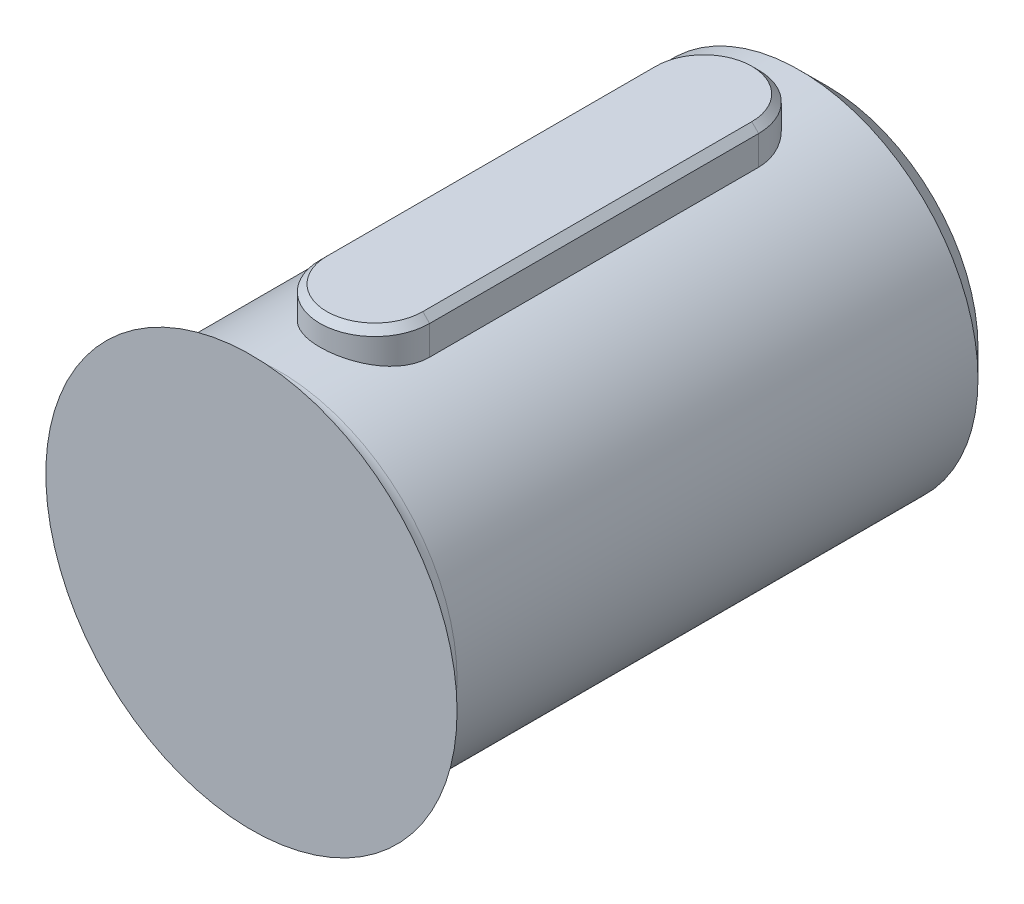
ISO-10303-21;
HEADER;
FILE_DESCRIPTION(('STEP AP214'),'2;1');
FILE_NAME('part.step','',(''),(''),'','','');
FILE_SCHEMA(('AUTOMOTIVE_DESIGN { 1 0 10303 214 1 1 1 1 }'));
ENDSEC;
DATA;
#1=APPLICATION_CONTEXT('core data for automotive mechanical design processes');
#2=APPLICATION_PROTOCOL_DEFINITION('international standard','automotive_design',2000,#1);
#3=PRODUCT_CONTEXT('',#1,'mechanical');
#4=PRODUCT('Part','Part','',(#3));
#5=PRODUCT_RELATED_PRODUCT_CATEGORY('part','',(#4));
#6=PRODUCT_DEFINITION_FORMATION('','',#4);
#7=PRODUCT_DEFINITION_CONTEXT('part definition',#1,'design');
#8=PRODUCT_DEFINITION('design','',#6,#7);
#9=PRODUCT_DEFINITION_SHAPE('','',#8);
#10=(LENGTH_UNIT() NAMED_UNIT(*) SI_UNIT(.MILLI.,.METRE.));
#11=(NAMED_UNIT(*) PLANE_ANGLE_UNIT() SI_UNIT($,.RADIAN.));
#12=(NAMED_UNIT(*) SI_UNIT($,.STERADIAN.) SOLID_ANGLE_UNIT());
#13=UNCERTAINTY_MEASURE_WITH_UNIT(LENGTH_MEASURE(1.E-05),#10,'distance_accuracy_value','');
#14=(GEOMETRIC_REPRESENTATION_CONTEXT(3) GLOBAL_UNCERTAINTY_ASSIGNED_CONTEXT((#13)) GLOBAL_UNIT_ASSIGNED_CONTEXT((#10,
#11,#12)) REPRESENTATION_CONTEXT('',''));
#15=CARTESIAN_POINT('',(0.,0.,0.));
#16=DIRECTION('',(0.,0.,1.));
#17=DIRECTION('',(1.,0.,0.));
#18=AXIS2_PLACEMENT_3D('',#15,#16,#17);
#19=CARTESIAN_POINT('',(0.,0.,-42.));
#20=DIRECTION('',(0.,0.,1.));
#21=DIRECTION('',(1.,0.,0.));
#22=AXIS2_PLACEMENT_3D('',#19,#20,#21);
#23=CYLINDRICAL_SURFACE('',#22,13.);
#24=CARTESIAN_POINT('',(0.,0.,-40.0000000000001));
#25=DIRECTION('',(0.,0.,-1.));
#26=DIRECTION('',(-1.,0.,0.));
#27=AXIS2_PLACEMENT_3D('',#24,#25,#26);
#28=CIRCLE('',#27,13.);
#29=CARTESIAN_POINT('',(-13.,0.,-40.0000000000001));
#30=VERTEX_POINT('',#29);
#31=EDGE_CURVE('E206',#30,#30,#28,.F.);
#32=ORIENTED_EDGE('',*,*,#31,.T.);
#33=EDGE_LOOP('',(#32));
#34=FACE_BOUND('',#33,.T.);
#35=CARTESIAN_POINT('',(0.,0.,-2.));
#36=DIRECTION('',(0.,0.,1.));
#37=DIRECTION('',(1.,0.,0.));
#38=AXIS2_PLACEMENT_3D('',#35,#36,#37);
#39=CIRCLE('',#38,13.);
#40=CARTESIAN_POINT('',(13.,0.,-2.));
#41=VERTEX_POINT('',#40);
#42=EDGE_CURVE('E203',#41,#41,#39,.F.);
#43=ORIENTED_EDGE('',*,*,#42,.T.);
#44=EDGE_LOOP('',(#43));
#45=FACE_BOUND('',#44,.T.);
#46=CARTESIAN_POINT('',(4.,12.3693168769667,-33.));
#47=CARTESIAN_POINT('',(4.00001385554601,12.3693011060968,-33.1096372600465));
#48=CARTESIAN_POINT('',(3.9954926492794,12.3707741918612,-33.2192655313837));
#49=CARTESIAN_POINT('',(3.97748793948686,12.376580829524,-33.4376823700838));
#50=CARTESIAN_POINT('',(3.96400653925937,12.3809137101182,-33.546471128451));
#51=CARTESIAN_POINT('',(3.92823615283488,12.3923078282801,-33.7621561512041));
#52=CARTESIAN_POINT('',(3.90597036349861,12.3993618789962,-33.8690566313903));
#53=CARTESIAN_POINT('',(3.85285190224528,12.41596961299,-34.0804758893773));
#54=CARTESIAN_POINT('',(3.82199898708869,12.425523367074,-34.1849945996211));
#55=CARTESIAN_POINT('',(3.71694513232237,12.4575175837839,-34.4938136119492));
#56=CARTESIAN_POINT('',(3.63020142616472,12.4833071563219,-34.693660963859));
#57=CARTESIAN_POINT('',(3.42599155981242,12.5408839490103,-35.0759730566992));
#58=CARTESIAN_POINT('',(3.30851008559726,12.5726741565623,-35.2584290710089));
#59=CARTESIAN_POINT('',(3.04197546691441,12.6398494642877,-35.6068944704928));
#60=CARTESIAN_POINT('',(2.89208104820597,12.6753137902435,-35.7722464055986));
#61=CARTESIAN_POINT('',(2.56677638136066,12.7451676286849,-36.0759050606228));
#62=CARTESIAN_POINT('',(2.39136178356476,12.7795569567314,-36.2142071607282));
#63=CARTESIAN_POINT('',(2.01525564039969,12.8442939900268,-36.4627491497716));
#64=CARTESIAN_POINT('',(1.81409533176034,12.874536901818,-36.5723094463524));
#65=CARTESIAN_POINT('',(1.39512400469652,12.9266435229388,-36.7557811144362));
#66=CARTESIAN_POINT('',(1.17731747269981,12.9485094805076,-36.8297020523467));
#67=CARTESIAN_POINT('',(0.738159816531911,12.9808366806595,-36.937600836779));
#68=CARTESIAN_POINT('',(0.517110769207851,12.9916202110488,-36.9727098340507));
#69=CARTESIAN_POINT('',(0.0720095541866108,13.0017046486492,-37.0055692569544));
#70=CARTESIAN_POINT('',(-0.15204200351301,13.001007853927,-37.0033271593168));
#71=CARTESIAN_POINT('',(-0.588828322831063,12.9884354452258,-36.9622968189123));
#72=CARTESIAN_POINT('',(-0.80169080127718,12.9769349637424,-36.9247349307764));
#73=CARTESIAN_POINT('',(-1.21792737917788,12.9445067865234,-36.8161398522419));
#74=CARTESIAN_POINT('',(-1.42130097258375,12.923578588634,-36.7451048789381));
#75=CARTESIAN_POINT('',(-1.81565284793223,12.8741371346769,-36.570777635441));
#76=CARTESIAN_POINT('',(-2.0064526345415,12.8455356806832,-36.4671076832871));
#77=CARTESIAN_POINT('',(-2.36833420474118,12.7837686435899,-36.2307457129176));
#78=CARTESIAN_POINT('',(-2.53941133301792,12.7506019869615,-36.0980468640843));
#79=CARTESIAN_POINT('',(-2.86427703671377,12.6816648743252,-35.8011250886285));
#80=CARTESIAN_POINT('',(-3.01708885727803,12.6458433558729,-35.6358457956717));
#81=CARTESIAN_POINT('',(-3.29318735473549,12.5767737605611,-35.2815126503951));
#82=CARTESIAN_POINT('',(-3.41646525186658,12.5435264509382,-35.0924517537567));
#83=CARTESIAN_POINT('',(-3.57703281324903,12.4983185398596,-34.7938396017284));
#84=CARTESIAN_POINT('',(-3.62672040706431,12.4839545575688,-34.6911363005515));
#85=CARTESIAN_POINT('',(-3.71721967743311,12.4573073197874,-34.4816454525288));
#86=CARTESIAN_POINT('',(-3.75803499898602,12.4450232102821,-34.3748596042002));
#87=CARTESIAN_POINT('',(-3.83039332264667,12.422943244649,-34.1580745856123));
#88=CARTESIAN_POINT('',(-3.86194614776927,12.4131447539952,-34.0480789565204));
#89=CARTESIAN_POINT('',(-3.91553543389505,12.3963449677283,-33.8256286652794));
#90=CARTESIAN_POINT('',(-3.93757627393638,12.3893423850727,-33.71317515977));
#91=CARTESIAN_POINT('',(-3.96980876445274,12.3790500430553,-33.5006880875188));
#92=CARTESIAN_POINT('',(-3.98112989977281,12.3754078485104,-33.4008413202037));
#93=CARTESIAN_POINT('',(-3.99622488400563,12.3705374921443,-33.2006656348954));
#94=CARTESIAN_POINT('',(-4.00000956907242,12.3693058643752,-33.1003376173747));
#95=CARTESIAN_POINT('',(-4.,12.369316876853,-33.0000000000055));
#96=B_SPLINE_CURVE_WITH_KNOTS('',3,(#46,#47,#48,#49,#50,#51,#52,#53,#54,#55,#56,#57,#58,#59,#60,
#61,#62,#63,#64,#65,#66,#67,#68,#69,#70,#71,#72,#73,#74,#75,#76,#77,#78,#79,#80,#81,#82,#83,#84,
#85,#86,#87,#88,#89,#90,#91,#92,#93,#94,#95),.UNSPECIFIED.,.F.,.F.,(4,2,2,2,2,2,2,2,2,2,2,2,2,2,
2,2,2,2,2,2,2,2,2,2,4),(0.,0.328793421205899,0.657509689331897,0.985363667710384,
1.31322693384867,1.96809857989641,2.62329711623842,3.29814780039836,3.97311364114569,
4.66283549044836,5.35237209963266,6.02123451699609,6.68996304688135,7.33629750680549,
7.98266639688031,8.63680913533219,9.29110596211812,9.97181686261232,10.6527298725315,
10.9973477032615,11.341823685796,11.685933015608,12.0298837581738,12.3312338730865,
12.6321503832073),.UNSPECIFIED.);
#97=CARTESIAN_POINT('',(4.,12.3693168768568,-33.));
#98=VERTEX_POINT('',#97);
#99=CARTESIAN_POINT('',(-4.,12.369316876853,-33.));
#100=VERTEX_POINT('',#99);
#101=EDGE_CURVE('E89',#98,#100,#96,.T.);
#102=ORIENTED_EDGE('',*,*,#101,.F.);
#103=DIRECTION('',(0.,0.,1.));
#104=VECTOR('',#103,1.);
#105=CARTESIAN_POINT('',(4.,12.369316876853,-42.));
#106=LINE('',#105,#104);
#107=CARTESIAN_POINT('',(4.,12.369316876853,-9.00000000000001));
#108=VERTEX_POINT('',#107);
#109=EDGE_CURVE('E101',#108,#98,#106,.F.);
#110=ORIENTED_EDGE('',*,*,#109,.F.);
#111=CARTESIAN_POINT('',(-4.,12.3693168769667,-9.00000000000001));
#112=CARTESIAN_POINT('',(-4.00001385554601,12.3693011060968,-8.8903627399535));
#113=CARTESIAN_POINT('',(-3.9954926492794,12.3707741918612,-8.78073446861628));
#114=CARTESIAN_POINT('',(-3.97748793948686,12.376580829524,-8.56231762991624));
#115=CARTESIAN_POINT('',(-3.96400653925937,12.3809137101182,-8.45352887154901));
#116=CARTESIAN_POINT('',(-3.92823615283488,12.3923078282801,-8.2378438487959));
#117=CARTESIAN_POINT('',(-3.90597036349861,12.3993618789962,-8.13094336860969));
#118=CARTESIAN_POINT('',(-3.85285190224528,12.41596961299,-7.91952411062271));
#119=CARTESIAN_POINT('',(-3.82199898708869,12.425523367074,-7.81500540037886));
#120=CARTESIAN_POINT('',(-3.71694513232237,12.4575175837839,-7.50618638805078));
#121=CARTESIAN_POINT('',(-3.63020142616471,12.4833071563219,-7.30633903614096));
#122=CARTESIAN_POINT('',(-3.42599155981242,12.5408839490103,-6.92402694330075));
#123=CARTESIAN_POINT('',(-3.30851008559726,12.5726741565623,-6.74157092899108));
#124=CARTESIAN_POINT('',(-3.0419754669144,12.6398494642877,-6.39310552950718));
#125=CARTESIAN_POINT('',(-2.89208104820596,12.6753137902435,-6.22775359440138));
#126=CARTESIAN_POINT('',(-2.56677638136065,12.7451676286849,-5.92409493937724));
#127=CARTESIAN_POINT('',(-2.39136178356475,12.7795569567314,-5.78579283927182));
#128=CARTESIAN_POINT('',(-2.01525564039969,12.8442939900268,-5.53725085022844));
#129=CARTESIAN_POINT('',(-1.81409533176033,12.874536901818,-5.42769055364756));
#130=CARTESIAN_POINT('',(-1.39512400469652,12.9266435229388,-5.24421888556385));
#131=CARTESIAN_POINT('',(-1.17731747269981,12.9485094805076,-5.17029794765327));
#132=CARTESIAN_POINT('',(-0.738159816531911,12.9808366806595,-5.06239916322103));
#133=CARTESIAN_POINT('',(-0.51711076920785,12.9916202110488,-5.02729016594929));
#134=CARTESIAN_POINT('',(-0.0720095541866099,13.0017046486492,-4.99443074304558));
#135=CARTESIAN_POINT('',(0.152042003513011,13.001007853927,-4.99667284068316));
#136=CARTESIAN_POINT('',(0.588828322831064,12.9884354452258,-5.03770318108776));
#137=CARTESIAN_POINT('',(0.801690801277182,12.9769349637424,-5.07526506922359));
#138=CARTESIAN_POINT('',(1.21792737917788,12.9445067865234,-5.18386014775806));
#139=CARTESIAN_POINT('',(1.42130097258375,12.923578588634,-5.25489512106192));
#140=CARTESIAN_POINT('',(1.81565284793223,12.8741371346769,-5.42922236455896));
#141=CARTESIAN_POINT('',(2.0064526345415,12.8455356806832,-5.53289231671289));
#142=CARTESIAN_POINT('',(2.36833420474119,12.7837686435899,-5.76925428708244));
#143=CARTESIAN_POINT('',(2.53941133301792,12.7506019869615,-5.9019531359157));
#144=CARTESIAN_POINT('',(2.86427703671377,12.6816648743252,-6.19887491137155));
#145=CARTESIAN_POINT('',(3.01708885727803,12.6458433558729,-6.36415420432831));
#146=CARTESIAN_POINT('',(3.29318735473549,12.5767737605611,-6.71848734960491));
#147=CARTESIAN_POINT('',(3.41646525186658,12.5435264509382,-6.90754824624329));
#148=CARTESIAN_POINT('',(3.57703281324904,12.4983185398596,-7.2061603982716));
#149=CARTESIAN_POINT('',(3.62672040706431,12.4839545575688,-7.30886369944852));
#150=CARTESIAN_POINT('',(3.71721967743312,12.4573073197874,-7.51835454747124));
#151=CARTESIAN_POINT('',(3.75803499898602,12.4450232102821,-7.62514039579979));
#152=CARTESIAN_POINT('',(3.83039332264667,12.422943244649,-7.84192541438775));
#153=CARTESIAN_POINT('',(3.86194614776927,12.4131447539952,-7.95192104347958));
#154=CARTESIAN_POINT('',(3.91553543389505,12.3963449677283,-8.17437133472061));
#155=CARTESIAN_POINT('',(3.93757627393638,12.3893423850727,-8.28682484023005));
#156=CARTESIAN_POINT('',(3.96980876445274,12.3790500430553,-8.49931191248125));
#157=CARTESIAN_POINT('',(3.98112989977281,12.3754078485104,-8.59915867979634));
#158=CARTESIAN_POINT('',(3.99622488400563,12.3705374921443,-8.79933436510464));
#159=CARTESIAN_POINT('',(4.00000956907242,12.3693058643752,-8.89966238262533));
#160=CARTESIAN_POINT('',(4.,12.369316876853,-8.9999999999945));
#161=B_SPLINE_CURVE_WITH_KNOTS('',3,(#111,#112,#113,#114,#115,#116,#117,#118,#119,#120,#121,
#122,#123,#124,#125,#126,#127,#128,#129,#130,#131,#132,#133,#134,#135,#136,#137,#138,#139,#140,
#141,#142,#143,#144,#145,#146,#147,#148,#149,#150,#151,#152,#153,#154,#155,#156,#157,#158,#159,
#160),.UNSPECIFIED.,.F.,.F.,(4,2,2,2,2,2,2,2,2,2,2,2,2,2,2,2,2,2,2,2,2,2,2,2,4),(0.,
0.328793421205901,0.657509689331896,0.985363667710386,1.31322693384867,1.96809857989642,
2.62329711623843,3.29814780039837,3.97311364114569,4.66283549044836,5.35237209963266,
6.02123451699609,6.68996304688135,7.33629750680549,7.98266639688031,8.63680913533219,
9.29110596211813,9.97181686261233,10.6527298725315,10.9973477032615,11.341823685796,
11.685933015608,12.0298837581738,12.3312338730865,12.6321503832073),.UNSPECIFIED.);
#162=CARTESIAN_POINT('',(-4.,12.369316876853,-9.00000000000001));
#163=VERTEX_POINT('',#162);
#164=EDGE_CURVE('E107',#163,#108,#161,.T.);
#165=ORIENTED_EDGE('',*,*,#164,.F.);
#166=DIRECTION('',(0.,0.,1.));
#167=VECTOR('',#166,1.);
#168=CARTESIAN_POINT('',(-4.,12.369316876853,-42.));
#169=LINE('',#168,#167);
#170=EDGE_CURVE('E104',#100,#163,#169,.T.);
#171=ORIENTED_EDGE('',*,*,#170,.F.);
#172=EDGE_LOOP('',(#102,#110,#165,#171));
#173=FACE_BOUND('',#172,.T.);
#174=ADVANCED_FACE('F32',(#34,#45,#173),#23,.T.);
#175=CARTESIAN_POINT('',(0.,0.,-42.));
#176=DIRECTION('',(0.,0.,-1.));
#177=DIRECTION('',(-1.,0.,0.));
#178=AXIS2_PLACEMENT_3D('',#175,#176,#177);
#179=PLANE('',#178);
#180=CARTESIAN_POINT('',(0.,0.,-42.));
#181=DIRECTION('',(0.,0.,-1.));
#182=DIRECTION('',(-1.,0.,0.));
#183=AXIS2_PLACEMENT_3D('',#180,#181,#182);
#184=CIRCLE('',#183,11.0000000000001);
#185=CARTESIAN_POINT('',(-11.0000000000001,0.,-42.));
#186=VERTEX_POINT('',#185);
#187=EDGE_CURVE('E209',#186,#186,#184,.T.);
#188=ORIENTED_EDGE('',*,*,#187,.T.);
#189=EDGE_LOOP('',(#188));
#190=FACE_BOUND('',#189,.T.);
#191=ADVANCED_FACE('F147',(#190),#179,.T.);
#192=CARTESIAN_POINT('',(0.,0.,-42.));
#193=DIRECTION('',(0.,0.,1.));
#194=DIRECTION('',(1.,0.,0.));
#195=AXIS2_PLACEMENT_3D('',#192,#193,#194);
#196=CONICAL_SURFACE('',#195,11.0000000000001,0.785398163397444);
#197=ORIENTED_EDGE('',*,*,#31,.F.);
#198=EDGE_LOOP('',(#197));
#199=FACE_BOUND('',#198,.T.);
#200=ORIENTED_EDGE('',*,*,#187,.F.);
#201=EDGE_LOOP('',(#200));
#202=FACE_BOUND('',#201,.T.);
#203=ADVANCED_FACE('F150',(#199,#202),#196,.T.);
#204=CARTESIAN_POINT('',(0.,0.,-2.));
#205=DIRECTION('',(0.,0.,1.));
#206=DIRECTION('',(1.,0.,0.));
#207=AXIS2_PLACEMENT_3D('',#204,#205,#206);
#208=TOROIDAL_SURFACE('',#207,15.,2.);
#209=CARTESIAN_POINT('',(0.,0.,0.));
#210=DIRECTION('',(0.,0.,1.));
#211=DIRECTION('',(1.,0.,0.));
#212=AXIS2_PLACEMENT_3D('',#209,#210,#211);
#213=CIRCLE('',#212,15.);
#214=CARTESIAN_POINT('',(15.,0.,0.));
#215=VERTEX_POINT('',#214);
#216=EDGE_CURVE('E113',#215,#215,#213,.F.);
#217=ORIENTED_EDGE('',*,*,#216,.T.);
#218=EDGE_LOOP('',(#217));
#219=FACE_BOUND('',#218,.T.);
#220=ORIENTED_EDGE('',*,*,#42,.F.);
#221=EDGE_LOOP('',(#220));
#222=FACE_BOUND('',#221,.T.);
#223=ADVANCED_FACE('F146',(#219,#222),#208,.F.);
#224=CARTESIAN_POINT('',(0.,15.,-33.));
#225=DIRECTION('',(0.,-1.,0.));
#226=DIRECTION('',(0.,0.,-1.));
#227=AXIS2_PLACEMENT_3D('',#224,#225,#226);
#228=CYLINDRICAL_SURFACE('',#227,4.);
#229=DIRECTION('',(0.,-1.,0.));
#230=VECTOR('',#229,1.);
#231=CARTESIAN_POINT('',(-4.,15.,-33.));
#232=LINE('',#231,#230);
#233=CARTESIAN_POINT('',(-4.,14.5,-33.));
#234=VERTEX_POINT('',#233);
#235=EDGE_CURVE('E212',#234,#100,#232,.T.);
#236=ORIENTED_EDGE('',*,*,#235,.F.);
#237=CARTESIAN_POINT('',(0.,14.5,-33.));
#238=DIRECTION('',(0.,1.,0.));
#239=DIRECTION('',(0.,0.,1.));
#240=AXIS2_PLACEMENT_3D('',#237,#238,#239);
#241=CIRCLE('',#240,4.);
#242=CARTESIAN_POINT('',(4.,14.5,-33.));
#243=VERTEX_POINT('',#242);
#244=EDGE_CURVE('E11',#234,#243,#241,.F.);
#245=ORIENTED_EDGE('',*,*,#244,.T.);
#246=DIRECTION('',(0.,-1.,0.));
#247=VECTOR('',#246,1.);
#248=CARTESIAN_POINT('',(4.,15.,-33.));
#249=LINE('',#248,#247);
#250=EDGE_CURVE('E86',#243,#98,#249,.T.);
#251=ORIENTED_EDGE('',*,*,#250,.T.);
#252=ORIENTED_EDGE('',*,*,#101,.T.);
#253=EDGE_LOOP('',(#236,#245,#251,#252));
#254=FACE_BOUND('',#253,.T.);
#255=ADVANCED_FACE('F88',(#254),#228,.T.);
#256=CARTESIAN_POINT('',(-4.,15.,-9.00000000000001));
#257=DIRECTION('',(1.,0.,0.));
#258=DIRECTION('',(0.,0.,-1.));
#259=AXIS2_PLACEMENT_3D('',#256,#257,#258);
#260=PLANE('',#259);
#261=DIRECTION('',(0.,-1.,0.));
#262=VECTOR('',#261,1.);
#263=CARTESIAN_POINT('',(-4.,15.,-9.00000000000001));
#264=LINE('',#263,#262);
#265=CARTESIAN_POINT('',(-4.,14.5,-9.00000000000001));
#266=VERTEX_POINT('',#265);
#267=EDGE_CURVE('E214',#266,#163,#264,.T.);
#268=ORIENTED_EDGE('',*,*,#267,.F.);
#269=DIRECTION('',(0.,0.,-1.));
#270=VECTOR('',#269,1.);
#271=CARTESIAN_POINT('',(-4.,14.5,-33.));
#272=LINE('',#271,#270);
#273=EDGE_CURVE('E41',#266,#234,#272,.T.);
#274=ORIENTED_EDGE('',*,*,#273,.T.);
#275=ORIENTED_EDGE('',*,*,#235,.T.);
#276=ORIENTED_EDGE('',*,*,#170,.T.);
#277=EDGE_LOOP('',(#268,#274,#275,#276));
#278=FACE_BOUND('',#277,.T.);
#279=ADVANCED_FACE('F141',(#278),#260,.F.);
#280=CARTESIAN_POINT('',(0.,15.,-9.00000000000001));
#281=DIRECTION('',(0.,-1.,0.));
#282=DIRECTION('',(0.,0.,-1.));
#283=AXIS2_PLACEMENT_3D('',#280,#281,#282);
#284=CYLINDRICAL_SURFACE('',#283,4.);
#285=DIRECTION('',(0.,-1.,0.));
#286=VECTOR('',#285,1.);
#287=CARTESIAN_POINT('',(4.,15.,-9.00000000000001));
#288=LINE('',#287,#286);
#289=CARTESIAN_POINT('',(4.,14.5,-9.00000000000001));
#290=VERTEX_POINT('',#289);
#291=EDGE_CURVE('E95',#290,#108,#288,.T.);
#292=ORIENTED_EDGE('',*,*,#291,.F.);
#293=CARTESIAN_POINT('',(0.,14.5,-9.00000000000001));
#294=DIRECTION('',(0.,1.,0.));
#295=DIRECTION('',(0.,0.,1.));
#296=AXIS2_PLACEMENT_3D('',#293,#294,#295);
#297=CIRCLE('',#296,4.);
#298=EDGE_CURVE('E56',#290,#266,#297,.F.);
#299=ORIENTED_EDGE('',*,*,#298,.T.);
#300=ORIENTED_EDGE('',*,*,#267,.T.);
#301=ORIENTED_EDGE('',*,*,#164,.T.);
#302=EDGE_LOOP('',(#292,#299,#300,#301));
#303=FACE_BOUND('',#302,.T.);
#304=ADVANCED_FACE('F138',(#303),#284,.T.);
#305=CARTESIAN_POINT('',(4.,15.,-9.00000000000001));
#306=DIRECTION('',(-1.,0.,0.));
#307=DIRECTION('',(0.,0.,1.));
#308=AXIS2_PLACEMENT_3D('',#305,#306,#307);
#309=PLANE('',#308);
#310=ORIENTED_EDGE('',*,*,#250,.F.);
#311=DIRECTION('',(0.,0.,1.));
#312=VECTOR('',#311,1.);
#313=CARTESIAN_POINT('',(4.,14.5,-9.00000000000001));
#314=LINE('',#313,#312);
#315=EDGE_CURVE('E185',#243,#290,#314,.T.);
#316=ORIENTED_EDGE('',*,*,#315,.T.);
#317=ORIENTED_EDGE('',*,*,#291,.T.);
#318=ORIENTED_EDGE('',*,*,#109,.T.);
#319=EDGE_LOOP('',(#310,#316,#317,#318));
#320=FACE_BOUND('',#319,.T.);
#321=ADVANCED_FACE('F106',(#320),#309,.F.);
#322=CARTESIAN_POINT('',(0.,15.,-33.));
#323=DIRECTION('',(0.,1.,0.));
#324=DIRECTION('',(0.,0.,1.));
#325=AXIS2_PLACEMENT_3D('',#322,#323,#324);
#326=PLANE('',#325);
#327=CARTESIAN_POINT('',(0.,15.,-9.00000000000001));
#328=DIRECTION('',(0.,1.,0.));
#329=DIRECTION('',(0.,0.,1.));
#330=AXIS2_PLACEMENT_3D('',#327,#328,#329);
#331=CIRCLE('',#330,3.49999999999999);
#332=CARTESIAN_POINT('',(-3.49999999999999,15.,-9.00000000000001));
#333=VERTEX_POINT('',#332);
#334=CARTESIAN_POINT('',(3.49999999999999,15.,-9.00000000000001));
#335=VERTEX_POINT('',#334);
#336=EDGE_CURVE('E179',#333,#335,#331,.T.);
#337=ORIENTED_EDGE('',*,*,#336,.T.);
#338=DIRECTION('',(0.,0.,-1.));
#339=VECTOR('',#338,1.);
#340=CARTESIAN_POINT('',(3.49999999999998,15.,-33.));
#341=LINE('',#340,#339);
#342=CARTESIAN_POINT('',(3.49999999999999,15.,-33.));
#343=VERTEX_POINT('',#342);
#344=EDGE_CURVE('E197',#335,#343,#341,.T.);
#345=ORIENTED_EDGE('',*,*,#344,.T.);
#346=CARTESIAN_POINT('',(0.,15.,-33.));
#347=DIRECTION('',(0.,1.,0.));
#348=DIRECTION('',(0.,0.,1.));
#349=AXIS2_PLACEMENT_3D('',#346,#347,#348);
#350=CIRCLE('',#349,3.49999999999999);
#351=CARTESIAN_POINT('',(-3.49999999999999,15.,-33.));
#352=VERTEX_POINT('',#351);
#353=EDGE_CURVE('E194',#343,#352,#350,.T.);
#354=ORIENTED_EDGE('',*,*,#353,.T.);
#355=DIRECTION('',(0.,0.,1.));
#356=VECTOR('',#355,1.);
#357=CARTESIAN_POINT('',(-3.49999999999999,15.,-9.00000000000001));
#358=LINE('',#357,#356);
#359=EDGE_CURVE('E182',#352,#333,#358,.T.);
#360=ORIENTED_EDGE('',*,*,#359,.T.);
#361=EDGE_LOOP('',(#337,#345,#354,#360));
#362=FACE_BOUND('',#361,.T.);
#363=ADVANCED_FACE('F131',(#362),#326,.T.);
#364=CARTESIAN_POINT('',(-3.49999999999999,15.,-33.));
#365=DIRECTION('',(-0.707106781186545,0.70710678118655,0.));
#366=DIRECTION('',(-0.70710678118655,-0.707106781186545,0.));
#367=AXIS2_PLACEMENT_3D('',#364,#365,#366);
#368=PLANE('',#367);
#369=DIRECTION('',(0.70710678118655,0.707106781186545,0.));
#370=VECTOR('',#369,1.);
#371=CARTESIAN_POINT('',(-4.,14.5,-33.));
#372=LINE('',#371,#370);
#373=EDGE_CURVE('E111',#234,#352,#372,.T.);
#374=ORIENTED_EDGE('',*,*,#373,.F.);
#375=ORIENTED_EDGE('',*,*,#273,.F.);
#376=DIRECTION('',(-0.70710678118655,-0.707106781186545,0.));
#377=VECTOR('',#376,1.);
#378=CARTESIAN_POINT('',(-3.49999999999999,15.,-9.00000000000001));
#379=LINE('',#378,#377);
#380=EDGE_CURVE('E36',#333,#266,#379,.T.);
#381=ORIENTED_EDGE('',*,*,#380,.F.);
#382=ORIENTED_EDGE('',*,*,#359,.F.);
#383=EDGE_LOOP('',(#374,#375,#381,#382));
#384=FACE_BOUND('',#383,.T.);
#385=ADVANCED_FACE('F34',(#384),#368,.T.);
#386=CARTESIAN_POINT('',(0.,15.,-9.00000000000001));
#387=DIRECTION('',(0.,-1.,0.));
#388=DIRECTION('',(0.,0.,-1.));
#389=AXIS2_PLACEMENT_3D('',#386,#387,#388);
#390=CONICAL_SURFACE('',#389,3.49999999999999,0.785398163397452);
#391=ORIENTED_EDGE('',*,*,#380,.T.);
#392=ORIENTED_EDGE('',*,*,#298,.F.);
#393=DIRECTION('',(0.70710678118655,-0.707106781186545,0.));
#394=VECTOR('',#393,1.);
#395=CARTESIAN_POINT('',(3.49999999999999,15.,-9.00000000000001));
#396=LINE('',#395,#394);
#397=EDGE_CURVE('E191',#335,#290,#396,.T.);
#398=ORIENTED_EDGE('',*,*,#397,.F.);
#399=ORIENTED_EDGE('',*,*,#336,.F.);
#400=EDGE_LOOP('',(#391,#392,#398,#399));
#401=FACE_BOUND('',#400,.T.);
#402=ADVANCED_FACE('F168',(#401),#390,.T.);
#403=CARTESIAN_POINT('',(0.,15.,-33.));
#404=DIRECTION('',(0.,-1.,0.));
#405=DIRECTION('',(0.,0.,-1.));
#406=AXIS2_PLACEMENT_3D('',#403,#404,#405);
#407=CONICAL_SURFACE('',#406,3.49999999999999,0.785398163397452);
#408=ORIENTED_EDGE('',*,*,#373,.T.);
#409=ORIENTED_EDGE('',*,*,#353,.F.);
#410=DIRECTION('',(-0.70710678118655,0.707106781186545,0.));
#411=VECTOR('',#410,1.);
#412=CARTESIAN_POINT('',(4.,14.5,-33.));
#413=LINE('',#412,#411);
#414=EDGE_CURVE('E189',#243,#343,#413,.T.);
#415=ORIENTED_EDGE('',*,*,#414,.F.);
#416=ORIENTED_EDGE('',*,*,#244,.F.);
#417=EDGE_LOOP('',(#408,#409,#415,#416));
#418=FACE_BOUND('',#417,.T.);
#419=ADVANCED_FACE('F165',(#418),#407,.T.);
#420=CARTESIAN_POINT('',(3.49999999999998,15.,-33.));
#421=DIRECTION('',(0.707106781186545,0.70710678118655,0.));
#422=DIRECTION('',(-0.70710678118655,0.707106781186545,0.));
#423=AXIS2_PLACEMENT_3D('',#420,#421,#422);
#424=PLANE('',#423);
#425=ORIENTED_EDGE('',*,*,#397,.T.);
#426=ORIENTED_EDGE('',*,*,#315,.F.);
#427=ORIENTED_EDGE('',*,*,#414,.T.);
#428=ORIENTED_EDGE('',*,*,#344,.F.);
#429=EDGE_LOOP('',(#425,#426,#427,#428));
#430=FACE_BOUND('',#429,.T.);
#431=ADVANCED_FACE('F161',(#430),#424,.T.);
#432=CARTESIAN_POINT('',(0.,0.,0.));
#433=DIRECTION('',(0.,0.,1.));
#434=DIRECTION('',(1.,0.,0.));
#435=AXIS2_PLACEMENT_3D('',#432,#433,#434);
#436=PLANE('',#435);
#437=ORIENTED_EDGE('',*,*,#216,.F.);
#438=EDGE_LOOP('',(#437));
#439=FACE_BOUND('',#438,.T.);
#440=ADVANCED_FACE('F164',(#439),#436,.T.);
#441=CLOSED_SHELL('',(#174,#191,#203,#223,#255,#279,#304,#321,#363,#385,#402,#419,#431,#440));
#442=MANIFOLD_SOLID_BREP('B2',#441);
#443=ADVANCED_BREP_SHAPE_REPRESENTATION('',(#18,#442),#14);
#444=SHAPE_DEFINITION_REPRESENTATION(#9,#443);
ENDSEC;
END-ISO-10303-21;
